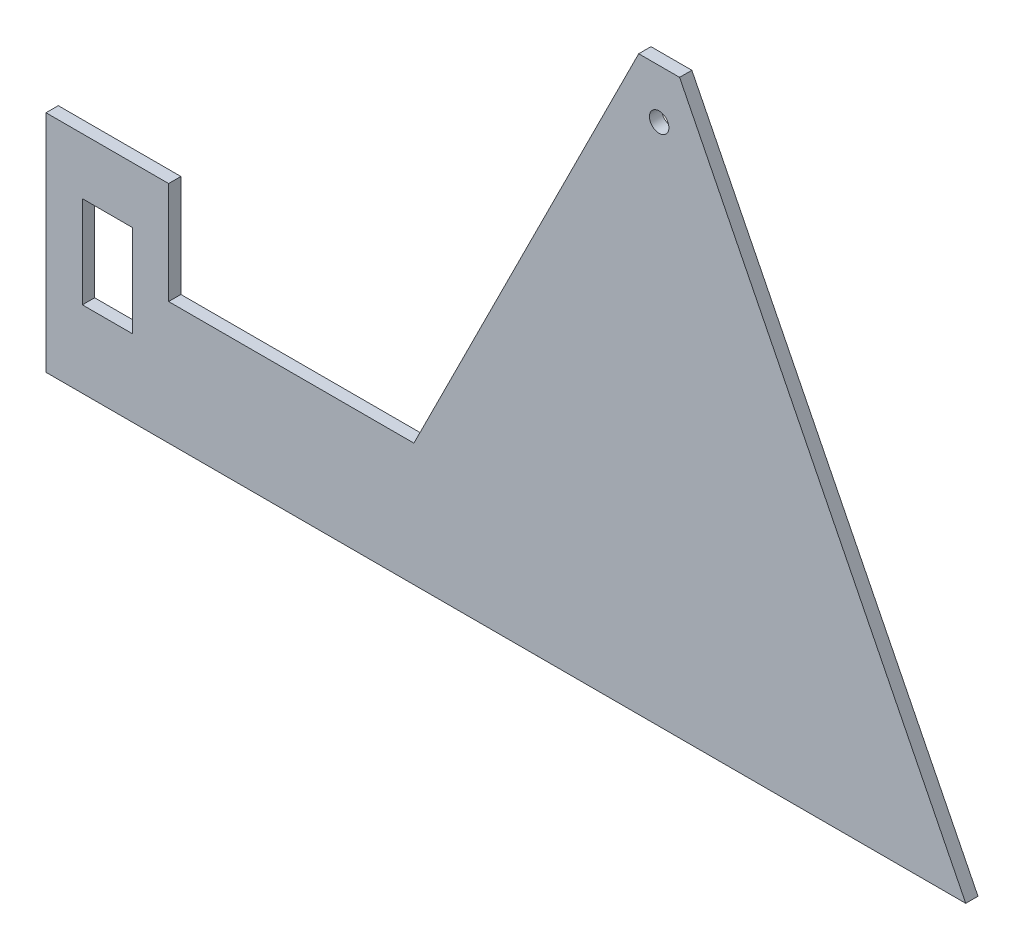
ISO-10303-21;
HEADER;
FILE_DESCRIPTION(('STEP AP214'),'2;1');
FILE_NAME('part.step','',(''),(''),'','','');
FILE_SCHEMA(('AUTOMOTIVE_DESIGN { 1 0 10303 214 1 1 1 1 }'));
ENDSEC;
DATA;
#1=APPLICATION_CONTEXT('core data for automotive mechanical design processes');
#2=APPLICATION_PROTOCOL_DEFINITION('international standard','automotive_design',2000,#1);
#3=PRODUCT_CONTEXT('',#1,'mechanical');
#4=PRODUCT('Part','Part','',(#3));
#5=PRODUCT_RELATED_PRODUCT_CATEGORY('part','',(#4));
#6=PRODUCT_DEFINITION_FORMATION('','',#4);
#7=PRODUCT_DEFINITION_CONTEXT('part definition',#1,'design');
#8=PRODUCT_DEFINITION('design','',#6,#7);
#9=PRODUCT_DEFINITION_SHAPE('','',#8);
#10=(LENGTH_UNIT() NAMED_UNIT(*) SI_UNIT(.MILLI.,.METRE.));
#11=(NAMED_UNIT(*) PLANE_ANGLE_UNIT() SI_UNIT($,.RADIAN.));
#12=(NAMED_UNIT(*) SI_UNIT($,.STERADIAN.) SOLID_ANGLE_UNIT());
#13=UNCERTAINTY_MEASURE_WITH_UNIT(LENGTH_MEASURE(1.E-05),#10,'distance_accuracy_value','');
#14=(GEOMETRIC_REPRESENTATION_CONTEXT(3) GLOBAL_UNCERTAINTY_ASSIGNED_CONTEXT((#13)) GLOBAL_UNIT_ASSIGNED_CONTEXT((#10,
#11,#12)) REPRESENTATION_CONTEXT('',''));
#15=CARTESIAN_POINT('',(0.,0.,0.));
#16=DIRECTION('',(0.,0.,1.));
#17=DIRECTION('',(1.,0.,0.));
#18=AXIS2_PLACEMENT_3D('',#15,#16,#17);
#19=CARTESIAN_POINT('',(0.,0.,3.));
#20=DIRECTION('',(0.,0.,-1.));
#21=DIRECTION('',(-1.,0.,0.));
#22=AXIS2_PLACEMENT_3D('',#19,#20,#21);
#23=PLANE('',#22);
#24=CARTESIAN_POINT('',(0.,128.,3.));
#25=DIRECTION('',(0.,0.,1.));
#26=DIRECTION('',(1.,0.,0.));
#27=AXIS2_PLACEMENT_3D('',#24,#25,#26);
#28=CIRCLE('',#27,2.38125);
#29=CARTESIAN_POINT('',(2.38125,128.,3.));
#30=VERTEX_POINT('',#29);
#31=EDGE_CURVE('E384',#30,#30,#28,.T.);
#32=ORIENTED_EDGE('',*,*,#31,.F.);
#33=EDGE_LOOP('',(#32));
#34=FACE_BOUND('',#33,.T.);
#35=DIRECTION('',(0.,1.,0.));
#36=VECTOR('',#35,1.);
#37=CARTESIAN_POINT('',(-128.9,41.25,3.));
#38=LINE('',#37,#36);
#39=CARTESIAN_POINT('',(-128.9,18.75,3.));
#40=VERTEX_POINT('',#39);
#41=CARTESIAN_POINT('',(-128.9,41.25,3.));
#42=VERTEX_POINT('',#41);
#43=EDGE_CURVE('E350',#40,#42,#38,.T.);
#44=ORIENTED_EDGE('',*,*,#43,.F.);
#45=DIRECTION('',(1.,0.,0.));
#46=VECTOR('',#45,1.);
#47=CARTESIAN_POINT('',(-141.1,18.75,3.));
#48=LINE('',#47,#46);
#49=CARTESIAN_POINT('',(-141.1,18.75,3.));
#50=VERTEX_POINT('',#49);
#51=EDGE_CURVE('E357',#50,#40,#48,.T.);
#52=ORIENTED_EDGE('',*,*,#51,.F.);
#53=DIRECTION('',(0.,-1.,0.));
#54=VECTOR('',#53,1.);
#55=CARTESIAN_POINT('',(-141.1,41.25,3.));
#56=LINE('',#55,#54);
#57=CARTESIAN_POINT('',(-141.1,41.25,3.));
#58=VERTEX_POINT('',#57);
#59=EDGE_CURVE('E355',#58,#50,#56,.T.);
#60=ORIENTED_EDGE('',*,*,#59,.F.);
#61=DIRECTION('',(-1.,0.,0.));
#62=VECTOR('',#61,1.);
#63=CARTESIAN_POINT('',(-141.1,41.25,3.));
#64=LINE('',#63,#62);
#65=EDGE_CURVE('E352',#42,#58,#64,.T.);
#66=ORIENTED_EDGE('',*,*,#65,.F.);
#67=EDGE_LOOP('',(#44,#52,#60,#66));
#68=FACE_BOUND('',#67,.T.);
#69=DIRECTION('',(1.,0.,0.));
#70=VECTOR('',#69,1.);
#71=CARTESIAN_POINT('',(-5.,140.,3.));
#72=LINE('',#71,#70);
#73=CARTESIAN_POINT('',(-5.,140.,3.));
#74=VERTEX_POINT('',#73);
#75=CARTESIAN_POINT('',(5.00000000000001,140.,3.));
#76=VERTEX_POINT('',#75);
#77=EDGE_CURVE('E123',#74,#76,#72,.T.);
#78=ORIENTED_EDGE('',*,*,#77,.F.);
#79=DIRECTION('',(-0.447213595499958,-0.894427190999916,0.));
#80=VECTOR('',#79,1.);
#81=CARTESIAN_POINT('',(-60.,30.,3.));
#82=LINE('',#81,#80);
#83=CARTESIAN_POINT('',(-60.,30.,3.));
#84=VERTEX_POINT('',#83);
#85=EDGE_CURVE('E133',#74,#84,#82,.T.);
#86=ORIENTED_EDGE('',*,*,#85,.T.);
#87=DIRECTION('',(-1.,0.,0.));
#88=VECTOR('',#87,1.);
#89=CARTESIAN_POINT('',(-120.,30.,3.));
#90=LINE('',#89,#88);
#91=CARTESIAN_POINT('',(-120.,30.,3.));
#92=VERTEX_POINT('',#91);
#93=EDGE_CURVE('E140',#84,#92,#90,.T.);
#94=ORIENTED_EDGE('',*,*,#93,.T.);
#95=DIRECTION('',(0.,1.,0.));
#96=VECTOR('',#95,1.);
#97=CARTESIAN_POINT('',(-120.,55.,3.));
#98=LINE('',#97,#96);
#99=CARTESIAN_POINT('',(-120.,55.,3.));
#100=VERTEX_POINT('',#99);
#101=EDGE_CURVE('E142',#92,#100,#98,.T.);
#102=ORIENTED_EDGE('',*,*,#101,.T.);
#103=DIRECTION('',(-1.,0.,0.));
#104=VECTOR('',#103,1.);
#105=CARTESIAN_POINT('',(-150.,55.,3.));
#106=LINE('',#105,#104);
#107=CARTESIAN_POINT('',(-150.,55.,3.));
#108=VERTEX_POINT('',#107);
#109=EDGE_CURVE('E149',#100,#108,#106,.T.);
#110=ORIENTED_EDGE('',*,*,#109,.T.);
#111=DIRECTION('',(0.,-1.,0.));
#112=VECTOR('',#111,1.);
#113=CARTESIAN_POINT('',(-150.,30.,3.));
#114=LINE('',#113,#112);
#115=CARTESIAN_POINT('',(-150.,0.,3.));
#116=VERTEX_POINT('',#115);
#117=EDGE_CURVE('E151',#108,#116,#114,.T.);
#118=ORIENTED_EDGE('',*,*,#117,.T.);
#119=DIRECTION('',(1.,0.,0.));
#120=VECTOR('',#119,1.);
#121=CARTESIAN_POINT('',(-75.,0.,3.));
#122=LINE('',#121,#120);
#123=CARTESIAN_POINT('',(75.,0.,3.));
#124=VERTEX_POINT('',#123);
#125=EDGE_CURVE('E153',#116,#124,#122,.T.);
#126=ORIENTED_EDGE('',*,*,#125,.T.);
#127=DIRECTION('',(-0.447213595499958,0.894427190999916,0.));
#128=VECTOR('',#127,1.);
#129=CARTESIAN_POINT('',(75.,0.,3.));
#130=LINE('',#129,#128);
#131=EDGE_CURVE('E136',#124,#76,#130,.T.);
#132=ORIENTED_EDGE('',*,*,#131,.T.);
#133=EDGE_LOOP('',(#78,#86,#94,#102,#110,#118,#126,#132));
#134=FACE_BOUND('',#133,.T.);
#135=ADVANCED_FACE('F34',(#34,#68,#134),#23,.F.);
#136=CARTESIAN_POINT('',(0.,0.,0.));
#137=DIRECTION('',(0.,0.,-1.));
#138=DIRECTION('',(-1.,0.,0.));
#139=AXIS2_PLACEMENT_3D('',#136,#137,#138);
#140=PLANE('',#139);
#141=CARTESIAN_POINT('',(0.,128.,0.));
#142=DIRECTION('',(0.,0.,1.));
#143=DIRECTION('',(1.,0.,0.));
#144=AXIS2_PLACEMENT_3D('',#141,#142,#143);
#145=CIRCLE('',#144,2.38125);
#146=CARTESIAN_POINT('',(2.38125,128.,0.));
#147=VERTEX_POINT('',#146);
#148=EDGE_CURVE('E386',#147,#147,#145,.T.);
#149=ORIENTED_EDGE('',*,*,#148,.T.);
#150=EDGE_LOOP('',(#149));
#151=FACE_BOUND('',#150,.T.);
#152=DIRECTION('',(1.,0.,0.));
#153=VECTOR('',#152,1.);
#154=CARTESIAN_POINT('',(-141.1,18.75,0.));
#155=LINE('',#154,#153);
#156=CARTESIAN_POINT('',(-141.1,18.75,0.));
#157=VERTEX_POINT('',#156);
#158=CARTESIAN_POINT('',(-128.9,18.75,0.));
#159=VERTEX_POINT('',#158);
#160=EDGE_CURVE('E353',#157,#159,#155,.T.);
#161=ORIENTED_EDGE('',*,*,#160,.T.);
#162=DIRECTION('',(0.,1.,0.));
#163=VECTOR('',#162,1.);
#164=CARTESIAN_POINT('',(-128.9,41.25,0.));
#165=LINE('',#164,#163);
#166=CARTESIAN_POINT('',(-128.9,41.25,0.));
#167=VERTEX_POINT('',#166);
#168=EDGE_CURVE('E128',#159,#167,#165,.T.);
#169=ORIENTED_EDGE('',*,*,#168,.T.);
#170=DIRECTION('',(-1.,0.,0.));
#171=VECTOR('',#170,1.);
#172=CARTESIAN_POINT('',(-141.1,41.25,0.));
#173=LINE('',#172,#171);
#174=CARTESIAN_POINT('',(-141.1,41.25,0.));
#175=VERTEX_POINT('',#174);
#176=EDGE_CURVE('E362',#167,#175,#173,.T.);
#177=ORIENTED_EDGE('',*,*,#176,.T.);
#178=DIRECTION('',(0.,-1.,0.));
#179=VECTOR('',#178,1.);
#180=CARTESIAN_POINT('',(-141.1,41.25,0.));
#181=LINE('',#180,#179);
#182=EDGE_CURVE('E365',#175,#157,#181,.T.);
#183=ORIENTED_EDGE('',*,*,#182,.T.);
#184=EDGE_LOOP('',(#161,#169,#177,#183));
#185=FACE_BOUND('',#184,.T.);
#186=DIRECTION('',(-0.447213595499958,-0.894427190999916,0.));
#187=VECTOR('',#186,1.);
#188=CARTESIAN_POINT('',(-60.,30.,0.));
#189=LINE('',#188,#187);
#190=CARTESIAN_POINT('',(-4.99999999999999,140.,0.));
#191=VERTEX_POINT('',#190);
#192=CARTESIAN_POINT('',(-60.,30.,0.));
#193=VERTEX_POINT('',#192);
#194=EDGE_CURVE('E159',#191,#193,#189,.T.);
#195=ORIENTED_EDGE('',*,*,#194,.F.);
#196=DIRECTION('',(1.,0.,0.));
#197=VECTOR('',#196,1.);
#198=CARTESIAN_POINT('',(-5.,140.,0.));
#199=LINE('',#198,#197);
#200=CARTESIAN_POINT('',(5.00000000000001,140.,0.));
#201=VERTEX_POINT('',#200);
#202=EDGE_CURVE('E49',#191,#201,#199,.T.);
#203=ORIENTED_EDGE('',*,*,#202,.T.);
#204=DIRECTION('',(-0.447213595499958,0.894427190999916,0.));
#205=VECTOR('',#204,1.);
#206=CARTESIAN_POINT('',(75.,0.,0.));
#207=LINE('',#206,#205);
#208=CARTESIAN_POINT('',(75.,0.,0.));
#209=VERTEX_POINT('',#208);
#210=EDGE_CURVE('E156',#209,#201,#207,.T.);
#211=ORIENTED_EDGE('',*,*,#210,.F.);
#212=DIRECTION('',(1.,0.,0.));
#213=VECTOR('',#212,1.);
#214=CARTESIAN_POINT('',(75.,0.,0.));
#215=LINE('',#214,#213);
#216=CARTESIAN_POINT('',(-150.,0.,0.));
#217=VERTEX_POINT('',#216);
#218=EDGE_CURVE('E144',#217,#209,#215,.T.);
#219=ORIENTED_EDGE('',*,*,#218,.F.);
#220=DIRECTION('',(0.,-1.,0.));
#221=VECTOR('',#220,1.);
#222=CARTESIAN_POINT('',(-150.,0.,0.));
#223=LINE('',#222,#221);
#224=CARTESIAN_POINT('',(-150.,55.,0.));
#225=VERTEX_POINT('',#224);
#226=EDGE_CURVE('E169',#225,#217,#223,.T.);
#227=ORIENTED_EDGE('',*,*,#226,.F.);
#228=DIRECTION('',(-1.,0.,0.));
#229=VECTOR('',#228,1.);
#230=CARTESIAN_POINT('',(-150.,55.,0.));
#231=LINE('',#230,#229);
#232=CARTESIAN_POINT('',(-120.,55.,0.));
#233=VERTEX_POINT('',#232);
#234=EDGE_CURVE('E166',#233,#225,#231,.T.);
#235=ORIENTED_EDGE('',*,*,#234,.F.);
#236=DIRECTION('',(0.,1.,0.));
#237=VECTOR('',#236,1.);
#238=CARTESIAN_POINT('',(-120.,55.,0.));
#239=LINE('',#238,#237);
#240=CARTESIAN_POINT('',(-120.,30.,0.));
#241=VERTEX_POINT('',#240);
#242=EDGE_CURVE('E164',#241,#233,#239,.T.);
#243=ORIENTED_EDGE('',*,*,#242,.F.);
#244=DIRECTION('',(-1.,0.,0.));
#245=VECTOR('',#244,1.);
#246=CARTESIAN_POINT('',(-120.,30.,0.));
#247=LINE('',#246,#245);
#248=EDGE_CURVE('E162',#193,#241,#247,.T.);
#249=ORIENTED_EDGE('',*,*,#248,.F.);
#250=EDGE_LOOP('',(#195,#203,#211,#219,#227,#235,#243,#249));
#251=FACE_BOUND('',#250,.T.);
#252=ADVANCED_FACE('F194',(#151,#185,#251),#140,.T.);
#253=CARTESIAN_POINT('',(75.,0.,3.));
#254=DIRECTION('',(-0.894427190999916,-0.447213595499958,0.));
#255=DIRECTION('',(0.447213595499958,-0.894427190999916,0.));
#256=AXIS2_PLACEMENT_3D('',#253,#254,#255);
#257=PLANE('',#256);
#258=DIRECTION('',(0.,0.,-1.));
#259=VECTOR('',#258,1.);
#260=CARTESIAN_POINT('',(5.00000000000001,140.,3.));
#261=LINE('',#260,#259);
#262=EDGE_CURVE('E129',#76,#201,#261,.T.);
#263=ORIENTED_EDGE('',*,*,#262,.F.);
#264=ORIENTED_EDGE('',*,*,#131,.F.);
#265=DIRECTION('',(0.,0.,-1.));
#266=VECTOR('',#265,1.);
#267=CARTESIAN_POINT('',(75.,0.,3.));
#268=LINE('',#267,#266);
#269=EDGE_CURVE('E155',#124,#209,#268,.T.);
#270=ORIENTED_EDGE('',*,*,#269,.T.);
#271=ORIENTED_EDGE('',*,*,#210,.T.);
#272=EDGE_LOOP('',(#263,#264,#270,#271));
#273=FACE_BOUND('',#272,.T.);
#274=ADVANCED_FACE('F36',(#273),#257,.F.);
#275=CARTESIAN_POINT('',(-60.,30.,3.));
#276=DIRECTION('',(0.894427190999916,-0.447213595499958,0.));
#277=DIRECTION('',(0.447213595499958,0.894427190999916,0.));
#278=AXIS2_PLACEMENT_3D('',#275,#276,#277);
#279=PLANE('',#278);
#280=DIRECTION('',(0.,0.,-1.));
#281=VECTOR('',#280,1.);
#282=CARTESIAN_POINT('',(-5.,140.,3.));
#283=LINE('',#282,#281);
#284=EDGE_CURVE('E120',#74,#191,#283,.T.);
#285=ORIENTED_EDGE('',*,*,#284,.T.);
#286=ORIENTED_EDGE('',*,*,#194,.T.);
#287=DIRECTION('',(0.,0.,-1.));
#288=VECTOR('',#287,1.);
#289=CARTESIAN_POINT('',(-60.,30.,3.));
#290=LINE('',#289,#288);
#291=EDGE_CURVE('E11',#84,#193,#290,.T.);
#292=ORIENTED_EDGE('',*,*,#291,.F.);
#293=ORIENTED_EDGE('',*,*,#85,.F.);
#294=EDGE_LOOP('',(#285,#286,#292,#293));
#295=FACE_BOUND('',#294,.T.);
#296=ADVANCED_FACE('F138',(#295),#279,.F.);
#297=CARTESIAN_POINT('',(-120.,30.,3.));
#298=DIRECTION('',(0.,-1.,0.));
#299=DIRECTION('',(1.,0.,0.));
#300=AXIS2_PLACEMENT_3D('',#297,#298,#299);
#301=PLANE('',#300);
#302=ORIENTED_EDGE('',*,*,#248,.T.);
#303=DIRECTION('',(0.,0.,-1.));
#304=VECTOR('',#303,1.);
#305=CARTESIAN_POINT('',(-120.,30.,3.));
#306=LINE('',#305,#304);
#307=EDGE_CURVE('E42',#92,#241,#306,.T.);
#308=ORIENTED_EDGE('',*,*,#307,.F.);
#309=ORIENTED_EDGE('',*,*,#93,.F.);
#310=ORIENTED_EDGE('',*,*,#291,.T.);
#311=EDGE_LOOP('',(#302,#308,#309,#310));
#312=FACE_BOUND('',#311,.T.);
#313=ADVANCED_FACE('F205',(#312),#301,.F.);
#314=CARTESIAN_POINT('',(-120.,55.,3.));
#315=DIRECTION('',(-1.,0.,0.));
#316=DIRECTION('',(0.,-1.,0.));
#317=AXIS2_PLACEMENT_3D('',#314,#315,#316);
#318=PLANE('',#317);
#319=ORIENTED_EDGE('',*,*,#242,.T.);
#320=DIRECTION('',(0.,0.,-1.));
#321=VECTOR('',#320,1.);
#322=CARTESIAN_POINT('',(-120.,55.,3.));
#323=LINE('',#322,#321);
#324=EDGE_CURVE('E181',#100,#233,#323,.T.);
#325=ORIENTED_EDGE('',*,*,#324,.F.);
#326=ORIENTED_EDGE('',*,*,#101,.F.);
#327=ORIENTED_EDGE('',*,*,#307,.T.);
#328=EDGE_LOOP('',(#319,#325,#326,#327));
#329=FACE_BOUND('',#328,.T.);
#330=ADVANCED_FACE('F188',(#329),#318,.F.);
#331=CARTESIAN_POINT('',(-150.,55.,3.));
#332=DIRECTION('',(0.,-1.,0.));
#333=DIRECTION('',(1.,0.,0.));
#334=AXIS2_PLACEMENT_3D('',#331,#332,#333);
#335=PLANE('',#334);
#336=ORIENTED_EDGE('',*,*,#234,.T.);
#337=DIRECTION('',(0.,0.,-1.));
#338=VECTOR('',#337,1.);
#339=CARTESIAN_POINT('',(-150.,55.,3.));
#340=LINE('',#339,#338);
#341=EDGE_CURVE('E178',#108,#225,#340,.T.);
#342=ORIENTED_EDGE('',*,*,#341,.F.);
#343=ORIENTED_EDGE('',*,*,#109,.F.);
#344=ORIENTED_EDGE('',*,*,#324,.T.);
#345=EDGE_LOOP('',(#336,#342,#343,#344));
#346=FACE_BOUND('',#345,.T.);
#347=ADVANCED_FACE('F197',(#346),#335,.F.);
#348=CARTESIAN_POINT('',(-150.,0.,3.));
#349=DIRECTION('',(1.,0.,0.));
#350=DIRECTION('',(0.,0.,-1.));
#351=AXIS2_PLACEMENT_3D('',#348,#349,#350);
#352=PLANE('',#351);
#353=ORIENTED_EDGE('',*,*,#226,.T.);
#354=DIRECTION('',(0.,0.,-1.));
#355=VECTOR('',#354,1.);
#356=CARTESIAN_POINT('',(-150.,0.,3.));
#357=LINE('',#356,#355);
#358=EDGE_CURVE('E175',#116,#217,#357,.T.);
#359=ORIENTED_EDGE('',*,*,#358,.F.);
#360=ORIENTED_EDGE('',*,*,#117,.F.);
#361=ORIENTED_EDGE('',*,*,#341,.T.);
#362=EDGE_LOOP('',(#353,#359,#360,#361));
#363=FACE_BOUND('',#362,.T.);
#364=ADVANCED_FACE('F201',(#363),#352,.F.);
#365=CARTESIAN_POINT('',(75.,0.,3.));
#366=DIRECTION('',(0.,1.,0.));
#367=DIRECTION('',(-1.,0.,0.));
#368=AXIS2_PLACEMENT_3D('',#365,#366,#367);
#369=PLANE('',#368);
#370=ORIENTED_EDGE('',*,*,#218,.T.);
#371=ORIENTED_EDGE('',*,*,#269,.F.);
#372=ORIENTED_EDGE('',*,*,#125,.F.);
#373=ORIENTED_EDGE('',*,*,#358,.T.);
#374=EDGE_LOOP('',(#370,#371,#372,#373));
#375=FACE_BOUND('',#374,.T.);
#376=ADVANCED_FACE('F227',(#375),#369,.F.);
#377=CARTESIAN_POINT('',(-128.9,41.25,3.));
#378=DIRECTION('',(-1.,0.,0.));
#379=DIRECTION('',(0.,0.,1.));
#380=AXIS2_PLACEMENT_3D('',#377,#378,#379);
#381=PLANE('',#380);
#382=ORIENTED_EDGE('',*,*,#168,.F.);
#383=DIRECTION('',(0.,0.,-1.));
#384=VECTOR('',#383,1.);
#385=CARTESIAN_POINT('',(-128.9,18.75,3.));
#386=LINE('',#385,#384);
#387=EDGE_CURVE('E359',#40,#159,#386,.T.);
#388=ORIENTED_EDGE('',*,*,#387,.F.);
#389=ORIENTED_EDGE('',*,*,#43,.T.);
#390=DIRECTION('',(0.,0.,-1.));
#391=VECTOR('',#390,1.);
#392=CARTESIAN_POINT('',(-128.9,41.25,3.));
#393=LINE('',#392,#391);
#394=EDGE_CURVE('E160',#42,#167,#393,.T.);
#395=ORIENTED_EDGE('',*,*,#394,.T.);
#396=EDGE_LOOP('',(#382,#388,#389,#395));
#397=FACE_BOUND('',#396,.T.);
#398=ADVANCED_FACE('F224',(#397),#381,.T.);
#399=CARTESIAN_POINT('',(-141.1,41.25,3.));
#400=DIRECTION('',(0.,-1.,0.));
#401=DIRECTION('',(1.,0.,0.));
#402=AXIS2_PLACEMENT_3D('',#399,#400,#401);
#403=PLANE('',#402);
#404=ORIENTED_EDGE('',*,*,#176,.F.);
#405=ORIENTED_EDGE('',*,*,#394,.F.);
#406=ORIENTED_EDGE('',*,*,#65,.T.);
#407=DIRECTION('',(0.,0.,-1.));
#408=VECTOR('',#407,1.);
#409=CARTESIAN_POINT('',(-141.1,41.25,3.));
#410=LINE('',#409,#408);
#411=EDGE_CURVE('E373',#58,#175,#410,.T.);
#412=ORIENTED_EDGE('',*,*,#411,.T.);
#413=EDGE_LOOP('',(#404,#405,#406,#412));
#414=FACE_BOUND('',#413,.T.);
#415=ADVANCED_FACE('F252',(#414),#403,.T.);
#416=CARTESIAN_POINT('',(-141.1,41.25,3.));
#417=DIRECTION('',(1.,0.,0.));
#418=DIRECTION('',(0.,1.,0.));
#419=AXIS2_PLACEMENT_3D('',#416,#417,#418);
#420=PLANE('',#419);
#421=ORIENTED_EDGE('',*,*,#182,.F.);
#422=ORIENTED_EDGE('',*,*,#411,.F.);
#423=ORIENTED_EDGE('',*,*,#59,.T.);
#424=DIRECTION('',(0.,0.,-1.));
#425=VECTOR('',#424,1.);
#426=CARTESIAN_POINT('',(-141.1,18.75,3.));
#427=LINE('',#426,#425);
#428=EDGE_CURVE('E57',#50,#157,#427,.T.);
#429=ORIENTED_EDGE('',*,*,#428,.T.);
#430=EDGE_LOOP('',(#421,#422,#423,#429));
#431=FACE_BOUND('',#430,.T.);
#432=ADVANCED_FACE('F259',(#431),#420,.T.);
#433=CARTESIAN_POINT('',(-141.1,18.75,3.));
#434=DIRECTION('',(0.,1.,0.));
#435=DIRECTION('',(0.,0.,1.));
#436=AXIS2_PLACEMENT_3D('',#433,#434,#435);
#437=PLANE('',#436);
#438=ORIENTED_EDGE('',*,*,#160,.F.);
#439=ORIENTED_EDGE('',*,*,#428,.F.);
#440=ORIENTED_EDGE('',*,*,#51,.T.);
#441=ORIENTED_EDGE('',*,*,#387,.T.);
#442=EDGE_LOOP('',(#438,#439,#440,#441));
#443=FACE_BOUND('',#442,.T.);
#444=ADVANCED_FACE('F266',(#443),#437,.T.);
#445=CARTESIAN_POINT('',(-5.,140.,3.));
#446=DIRECTION('',(0.,1.,0.));
#447=DIRECTION('',(0.,0.,1.));
#448=AXIS2_PLACEMENT_3D('',#445,#446,#447);
#449=PLANE('',#448);
#450=ORIENTED_EDGE('',*,*,#202,.F.);
#451=ORIENTED_EDGE('',*,*,#284,.F.);
#452=ORIENTED_EDGE('',*,*,#77,.T.);
#453=ORIENTED_EDGE('',*,*,#262,.T.);
#454=EDGE_LOOP('',(#450,#451,#452,#453));
#455=FACE_BOUND('',#454,.T.);
#456=ADVANCED_FACE('F122',(#455),#449,.T.);
#457=CARTESIAN_POINT('',(0.,128.,3.));
#458=DIRECTION('',(0.,0.,-1.));
#459=DIRECTION('',(-1.,0.,0.));
#460=AXIS2_PLACEMENT_3D('',#457,#458,#459);
#461=CYLINDRICAL_SURFACE('',#460,2.38125);
#462=ORIENTED_EDGE('',*,*,#31,.T.);
#463=EDGE_LOOP('',(#462));
#464=FACE_BOUND('',#463,.T.);
#465=ORIENTED_EDGE('',*,*,#148,.F.);
#466=EDGE_LOOP('',(#465));
#467=FACE_BOUND('',#466,.T.);
#468=ADVANCED_FACE('F280',(#464,#467),#461,.F.);
#469=CLOSED_SHELL('',(#135,#252,#274,#296,#313,#330,#347,#364,#376,#398,#415,#432,#444,#456,#468));
#470=MANIFOLD_SOLID_BREP('B2',#469);
#471=ADVANCED_BREP_SHAPE_REPRESENTATION('',(#18,#470),#14);
#472=SHAPE_DEFINITION_REPRESENTATION(#9,#471);
ENDSEC;
END-ISO-10303-21;
